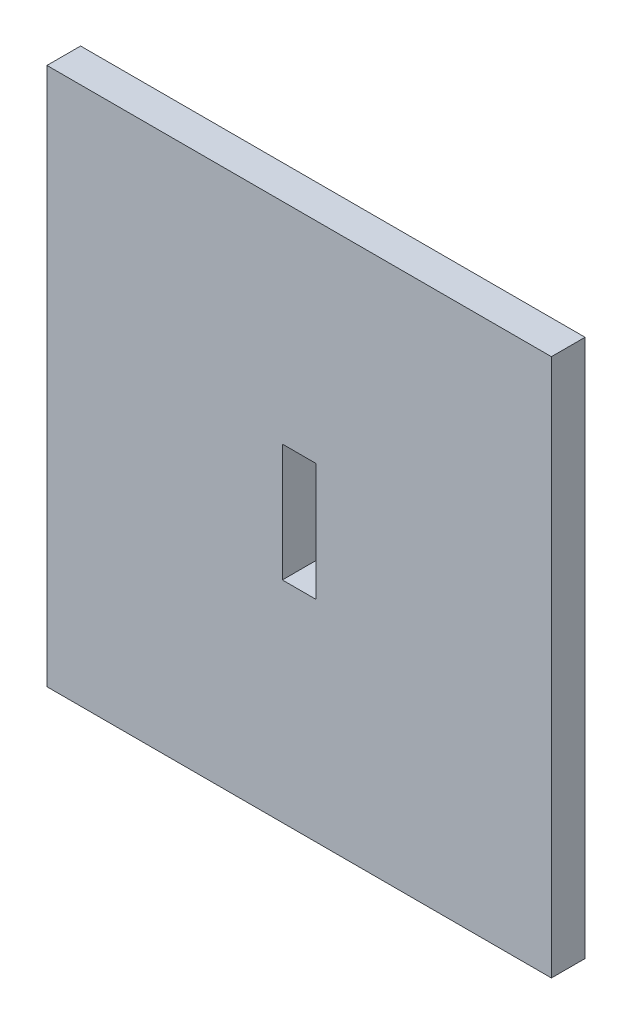
ISO-10303-21;
HEADER;
FILE_DESCRIPTION(('STEP AP214'),'2;1');
FILE_NAME('part.step','',(''),(''),'','','');
FILE_SCHEMA(('AUTOMOTIVE_DESIGN { 1 0 10303 214 1 1 1 1 }'));
ENDSEC;
DATA;
#1=APPLICATION_CONTEXT('core data for automotive mechanical design processes');
#2=APPLICATION_PROTOCOL_DEFINITION('international standard','automotive_design',2000,#1);
#3=PRODUCT_CONTEXT('',#1,'mechanical');
#4=PRODUCT('Part','Part','',(#3));
#5=PRODUCT_RELATED_PRODUCT_CATEGORY('part','',(#4));
#6=PRODUCT_DEFINITION_FORMATION('','',#4);
#7=PRODUCT_DEFINITION_CONTEXT('part definition',#1,'design');
#8=PRODUCT_DEFINITION('design','',#6,#7);
#9=PRODUCT_DEFINITION_SHAPE('','',#8);
#10=(LENGTH_UNIT() NAMED_UNIT(*) SI_UNIT(.MILLI.,.METRE.));
#11=(NAMED_UNIT(*) PLANE_ANGLE_UNIT() SI_UNIT($,.RADIAN.));
#12=(NAMED_UNIT(*) SI_UNIT($,.STERADIAN.) SOLID_ANGLE_UNIT());
#13=UNCERTAINTY_MEASURE_WITH_UNIT(LENGTH_MEASURE(1.E-05),#10,'distance_accuracy_value','');
#14=(GEOMETRIC_REPRESENTATION_CONTEXT(3) GLOBAL_UNCERTAINTY_ASSIGNED_CONTEXT((#13)) GLOBAL_UNIT_ASSIGNED_CONTEXT((#10,
#11,#12)) REPRESENTATION_CONTEXT('',''));
#15=CARTESIAN_POINT('',(0.,0.,0.));
#16=DIRECTION('',(0.,0.,1.));
#17=DIRECTION('',(1.,0.,0.));
#18=AXIS2_PLACEMENT_3D('',#15,#16,#17);
#19=CARTESIAN_POINT('',(0.,0.,2.));
#20=DIRECTION('',(0.,0.,-1.));
#21=DIRECTION('',(-1.,0.,0.));
#22=AXIS2_PLACEMENT_3D('',#19,#20,#21);
#23=PLANE('',#22);
#24=DIRECTION('',(0.,1.,0.));
#25=VECTOR('',#24,1.);
#26=CARTESIAN_POINT('',(15.,-16.,2.));
#27=LINE('',#26,#25);
#28=CARTESIAN_POINT('',(15.,-16.,2.));
#29=VERTEX_POINT('',#28);
#30=CARTESIAN_POINT('',(15.,16.,2.));
#31=VERTEX_POINT('',#30);
#32=EDGE_CURVE('E133',#29,#31,#27,.T.);
#33=ORIENTED_EDGE('',*,*,#32,.T.);
#34=DIRECTION('',(-1.,0.,0.));
#35=VECTOR('',#34,1.);
#36=CARTESIAN_POINT('',(-15.,16.,2.));
#37=LINE('',#36,#35);
#38=CARTESIAN_POINT('',(-15.,16.,2.));
#39=VERTEX_POINT('',#38);
#40=EDGE_CURVE('E136',#31,#39,#37,.T.);
#41=ORIENTED_EDGE('',*,*,#40,.T.);
#42=DIRECTION('',(0.,-1.,0.));
#43=VECTOR('',#42,1.);
#44=CARTESIAN_POINT('',(-15.,-16.,2.));
#45=LINE('',#44,#43);
#46=CARTESIAN_POINT('',(-15.,-16.,2.));
#47=VERTEX_POINT('',#46);
#48=EDGE_CURVE('E139',#39,#47,#45,.T.);
#49=ORIENTED_EDGE('',*,*,#48,.T.);
#50=DIRECTION('',(1.,0.,0.));
#51=VECTOR('',#50,1.);
#52=CARTESIAN_POINT('',(-15.,-16.,2.));
#53=LINE('',#52,#51);
#54=EDGE_CURVE('E141',#47,#29,#53,.T.);
#55=ORIENTED_EDGE('',*,*,#54,.T.);
#56=EDGE_LOOP('',(#33,#41,#49,#55));
#57=FACE_BOUND('',#56,.T.);
#58=DIRECTION('',(0.,-1.,0.));
#59=VECTOR('',#58,1.);
#60=CARTESIAN_POINT('',(-1.,-3.5,2.));
#61=LINE('',#60,#59);
#62=CARTESIAN_POINT('',(-1.,3.5,2.));
#63=VERTEX_POINT('',#62);
#64=CARTESIAN_POINT('',(-1.,-3.5,2.));
#65=VERTEX_POINT('',#64);
#66=EDGE_CURVE('E97',#63,#65,#61,.T.);
#67=ORIENTED_EDGE('',*,*,#66,.F.);
#68=DIRECTION('',(-1.,0.,0.));
#69=VECTOR('',#68,1.);
#70=CARTESIAN_POINT('',(0.999999999999996,3.5,2.));
#71=LINE('',#70,#69);
#72=CARTESIAN_POINT('',(0.999999999999996,3.5,2.));
#73=VERTEX_POINT('',#72);
#74=EDGE_CURVE('E119',#73,#63,#71,.T.);
#75=ORIENTED_EDGE('',*,*,#74,.F.);
#76=DIRECTION('',(0.,1.,0.));
#77=VECTOR('',#76,1.);
#78=CARTESIAN_POINT('',(0.999999999999996,-3.5,2.));
#79=LINE('',#78,#77);
#80=CARTESIAN_POINT('',(0.999999999999996,-3.5,2.));
#81=VERTEX_POINT('',#80);
#82=EDGE_CURVE('E117',#81,#73,#79,.T.);
#83=ORIENTED_EDGE('',*,*,#82,.F.);
#84=DIRECTION('',(1.,0.,0.));
#85=VECTOR('',#84,1.);
#86=CARTESIAN_POINT('',(0.999999999999996,-3.5,2.));
#87=LINE('',#86,#85);
#88=EDGE_CURVE('E105',#65,#81,#87,.T.);
#89=ORIENTED_EDGE('',*,*,#88,.F.);
#90=EDGE_LOOP('',(#67,#75,#83,#89));
#91=FACE_BOUND('',#90,.T.);
#92=ADVANCED_FACE('F32',(#57,#91),#23,.F.);
#93=CARTESIAN_POINT('',(0.,0.,0.));
#94=DIRECTION('',(0.,0.,-1.));
#95=DIRECTION('',(-1.,0.,0.));
#96=AXIS2_PLACEMENT_3D('',#93,#94,#95);
#97=PLANE('',#96);
#98=DIRECTION('',(0.,1.,0.));
#99=VECTOR('',#98,1.);
#100=CARTESIAN_POINT('',(15.,-16.,0.));
#101=LINE('',#100,#99);
#102=CARTESIAN_POINT('',(15.,-16.,0.));
#103=VERTEX_POINT('',#102);
#104=CARTESIAN_POINT('',(15.,16.,0.));
#105=VERTEX_POINT('',#104);
#106=EDGE_CURVE('E113',#103,#105,#101,.T.);
#107=ORIENTED_EDGE('',*,*,#106,.F.);
#108=DIRECTION('',(1.,0.,0.));
#109=VECTOR('',#108,1.);
#110=CARTESIAN_POINT('',(-15.,-16.,0.));
#111=LINE('',#110,#109);
#112=CARTESIAN_POINT('',(-15.,-16.,0.));
#113=VERTEX_POINT('',#112);
#114=EDGE_CURVE('E137',#113,#103,#111,.T.);
#115=ORIENTED_EDGE('',*,*,#114,.F.);
#116=DIRECTION('',(0.,-1.,0.));
#117=VECTOR('',#116,1.);
#118=CARTESIAN_POINT('',(-15.,-16.,0.));
#119=LINE('',#118,#117);
#120=CARTESIAN_POINT('',(-15.,16.,0.));
#121=VERTEX_POINT('',#120);
#122=EDGE_CURVE('E148',#121,#113,#119,.T.);
#123=ORIENTED_EDGE('',*,*,#122,.F.);
#124=DIRECTION('',(-1.,0.,0.));
#125=VECTOR('',#124,1.);
#126=CARTESIAN_POINT('',(-15.,16.,0.));
#127=LINE('',#126,#125);
#128=EDGE_CURVE('E146',#105,#121,#127,.T.);
#129=ORIENTED_EDGE('',*,*,#128,.F.);
#130=EDGE_LOOP('',(#107,#115,#123,#129));
#131=FACE_BOUND('',#130,.T.);
#132=DIRECTION('',(-1.,0.,0.));
#133=VECTOR('',#132,1.);
#134=CARTESIAN_POINT('',(0.999999999999996,3.5,0.));
#135=LINE('',#134,#133);
#136=CARTESIAN_POINT('',(0.999999999999996,3.5,0.));
#137=VERTEX_POINT('',#136);
#138=CARTESIAN_POINT('',(-1.,3.5,0.));
#139=VERTEX_POINT('',#138);
#140=EDGE_CURVE('E106',#137,#139,#135,.T.);
#141=ORIENTED_EDGE('',*,*,#140,.T.);
#142=DIRECTION('',(0.,-1.,0.));
#143=VECTOR('',#142,1.);
#144=CARTESIAN_POINT('',(-1.,-3.5,0.));
#145=LINE('',#144,#143);
#146=CARTESIAN_POINT('',(-1.,-3.5,0.));
#147=VERTEX_POINT('',#146);
#148=EDGE_CURVE('E55',#139,#147,#145,.T.);
#149=ORIENTED_EDGE('',*,*,#148,.T.);
#150=DIRECTION('',(1.,0.,0.));
#151=VECTOR('',#150,1.);
#152=CARTESIAN_POINT('',(0.999999999999996,-3.5,0.));
#153=LINE('',#152,#151);
#154=CARTESIAN_POINT('',(0.999999999999996,-3.5,0.));
#155=VERTEX_POINT('',#154);
#156=EDGE_CURVE('E112',#147,#155,#153,.T.);
#157=ORIENTED_EDGE('',*,*,#156,.T.);
#158=DIRECTION('',(0.,1.,0.));
#159=VECTOR('',#158,1.);
#160=CARTESIAN_POINT('',(0.999999999999996,-3.5,0.));
#161=LINE('',#160,#159);
#162=EDGE_CURVE('E125',#155,#137,#161,.T.);
#163=ORIENTED_EDGE('',*,*,#162,.T.);
#164=EDGE_LOOP('',(#141,#149,#157,#163));
#165=FACE_BOUND('',#164,.T.);
#166=ADVANCED_FACE('F166',(#131,#165),#97,.T.);
#167=CARTESIAN_POINT('',(15.,-16.,2.));
#168=DIRECTION('',(-1.,0.,0.));
#169=DIRECTION('',(0.,0.,1.));
#170=AXIS2_PLACEMENT_3D('',#167,#168,#169);
#171=PLANE('',#170);
#172=ORIENTED_EDGE('',*,*,#106,.T.);
#173=DIRECTION('',(0.,0.,-1.));
#174=VECTOR('',#173,1.);
#175=CARTESIAN_POINT('',(15.,16.,2.));
#176=LINE('',#175,#174);
#177=EDGE_CURVE('E11',#31,#105,#176,.T.);
#178=ORIENTED_EDGE('',*,*,#177,.F.);
#179=ORIENTED_EDGE('',*,*,#32,.F.);
#180=DIRECTION('',(0.,0.,-1.));
#181=VECTOR('',#180,1.);
#182=CARTESIAN_POINT('',(15.,-16.,2.));
#183=LINE('',#182,#181);
#184=EDGE_CURVE('E143',#29,#103,#183,.T.);
#185=ORIENTED_EDGE('',*,*,#184,.T.);
#186=EDGE_LOOP('',(#172,#178,#179,#185));
#187=FACE_BOUND('',#186,.T.);
#188=ADVANCED_FACE('F34',(#187),#171,.F.);
#189=CARTESIAN_POINT('',(-15.,16.,2.));
#190=DIRECTION('',(0.,-1.,0.));
#191=DIRECTION('',(0.,0.,-1.));
#192=AXIS2_PLACEMENT_3D('',#189,#190,#191);
#193=PLANE('',#192);
#194=ORIENTED_EDGE('',*,*,#128,.T.);
#195=DIRECTION('',(0.,0.,-1.));
#196=VECTOR('',#195,1.);
#197=CARTESIAN_POINT('',(-15.,16.,2.));
#198=LINE('',#197,#196);
#199=EDGE_CURVE('E40',#39,#121,#198,.T.);
#200=ORIENTED_EDGE('',*,*,#199,.F.);
#201=ORIENTED_EDGE('',*,*,#40,.F.);
#202=ORIENTED_EDGE('',*,*,#177,.T.);
#203=EDGE_LOOP('',(#194,#200,#201,#202));
#204=FACE_BOUND('',#203,.T.);
#205=ADVANCED_FACE('F176',(#204),#193,.F.);
#206=CARTESIAN_POINT('',(-15.,-16.,2.));
#207=DIRECTION('',(1.,0.,0.));
#208=DIRECTION('',(0.,0.,-1.));
#209=AXIS2_PLACEMENT_3D('',#206,#207,#208);
#210=PLANE('',#209);
#211=ORIENTED_EDGE('',*,*,#122,.T.);
#212=DIRECTION('',(0.,0.,-1.));
#213=VECTOR('',#212,1.);
#214=CARTESIAN_POINT('',(-15.,-16.,2.));
#215=LINE('',#214,#213);
#216=EDGE_CURVE('E153',#47,#113,#215,.T.);
#217=ORIENTED_EDGE('',*,*,#216,.F.);
#218=ORIENTED_EDGE('',*,*,#48,.F.);
#219=ORIENTED_EDGE('',*,*,#199,.T.);
#220=EDGE_LOOP('',(#211,#217,#218,#219));
#221=FACE_BOUND('',#220,.T.);
#222=ADVANCED_FACE('F160',(#221),#210,.F.);
#223=CARTESIAN_POINT('',(-15.,-16.,2.));
#224=DIRECTION('',(0.,1.,0.));
#225=DIRECTION('',(0.,0.,1.));
#226=AXIS2_PLACEMENT_3D('',#223,#224,#225);
#227=PLANE('',#226);
#228=ORIENTED_EDGE('',*,*,#114,.T.);
#229=ORIENTED_EDGE('',*,*,#184,.F.);
#230=ORIENTED_EDGE('',*,*,#54,.F.);
#231=ORIENTED_EDGE('',*,*,#216,.T.);
#232=EDGE_LOOP('',(#228,#229,#230,#231));
#233=FACE_BOUND('',#232,.T.);
#234=ADVANCED_FACE('F170',(#233),#227,.F.);
#235=CARTESIAN_POINT('',(-1.,-3.5,2.));
#236=DIRECTION('',(1.,0.,0.));
#237=DIRECTION('',(0.,0.,-1.));
#238=AXIS2_PLACEMENT_3D('',#235,#236,#237);
#239=PLANE('',#238);
#240=ORIENTED_EDGE('',*,*,#148,.F.);
#241=DIRECTION('',(0.,0.,-1.));
#242=VECTOR('',#241,1.);
#243=CARTESIAN_POINT('',(-1.,3.5,2.));
#244=LINE('',#243,#242);
#245=EDGE_CURVE('E101',#63,#139,#244,.T.);
#246=ORIENTED_EDGE('',*,*,#245,.F.);
#247=ORIENTED_EDGE('',*,*,#66,.T.);
#248=DIRECTION('',(0.,0.,-1.));
#249=VECTOR('',#248,1.);
#250=CARTESIAN_POINT('',(-1.,-3.5,2.));
#251=LINE('',#250,#249);
#252=EDGE_CURVE('E100',#65,#147,#251,.T.);
#253=ORIENTED_EDGE('',*,*,#252,.T.);
#254=EDGE_LOOP('',(#240,#246,#247,#253));
#255=FACE_BOUND('',#254,.T.);
#256=ADVANCED_FACE('F99',(#255),#239,.T.);
#257=CARTESIAN_POINT('',(0.999999999999996,-3.5,2.));
#258=DIRECTION('',(0.,1.,0.));
#259=DIRECTION('',(0.,0.,1.));
#260=AXIS2_PLACEMENT_3D('',#257,#258,#259);
#261=PLANE('',#260);
#262=ORIENTED_EDGE('',*,*,#156,.F.);
#263=ORIENTED_EDGE('',*,*,#252,.F.);
#264=ORIENTED_EDGE('',*,*,#88,.T.);
#265=DIRECTION('',(0.,0.,-1.));
#266=VECTOR('',#265,1.);
#267=CARTESIAN_POINT('',(0.999999999999996,-3.5,2.));
#268=LINE('',#267,#266);
#269=EDGE_CURVE('E114',#81,#155,#268,.T.);
#270=ORIENTED_EDGE('',*,*,#269,.T.);
#271=EDGE_LOOP('',(#262,#263,#264,#270));
#272=FACE_BOUND('',#271,.T.);
#273=ADVANCED_FACE('F109',(#272),#261,.T.);
#274=CARTESIAN_POINT('',(0.999999999999996,-3.5,2.));
#275=DIRECTION('',(-1.,0.,0.));
#276=DIRECTION('',(0.,0.,1.));
#277=AXIS2_PLACEMENT_3D('',#274,#275,#276);
#278=PLANE('',#277);
#279=ORIENTED_EDGE('',*,*,#162,.F.);
#280=ORIENTED_EDGE('',*,*,#269,.F.);
#281=ORIENTED_EDGE('',*,*,#82,.T.);
#282=DIRECTION('',(0.,0.,-1.));
#283=VECTOR('',#282,1.);
#284=CARTESIAN_POINT('',(0.999999999999996,3.5,2.));
#285=LINE('',#284,#283);
#286=EDGE_CURVE('E47',#73,#137,#285,.T.);
#287=ORIENTED_EDGE('',*,*,#286,.T.);
#288=EDGE_LOOP('',(#279,#280,#281,#287));
#289=FACE_BOUND('',#288,.T.);
#290=ADVANCED_FACE('F199',(#289),#278,.T.);
#291=CARTESIAN_POINT('',(0.999999999999996,3.5,2.));
#292=DIRECTION('',(0.,-1.,0.));
#293=DIRECTION('',(0.,0.,-1.));
#294=AXIS2_PLACEMENT_3D('',#291,#292,#293);
#295=PLANE('',#294);
#296=ORIENTED_EDGE('',*,*,#140,.F.);
#297=ORIENTED_EDGE('',*,*,#286,.F.);
#298=ORIENTED_EDGE('',*,*,#74,.T.);
#299=ORIENTED_EDGE('',*,*,#245,.T.);
#300=EDGE_LOOP('',(#296,#297,#298,#299));
#301=FACE_BOUND('',#300,.T.);
#302=ADVANCED_FACE('F203',(#301),#295,.T.);
#303=CLOSED_SHELL('',(#92,#166,#188,#205,#222,#234,#256,#273,#290,#302));
#304=MANIFOLD_SOLID_BREP('B2',#303);
#305=ADVANCED_BREP_SHAPE_REPRESENTATION('',(#18,#304),#14);
#306=SHAPE_DEFINITION_REPRESENTATION(#9,#305);
ENDSEC;
END-ISO-10303-21;
